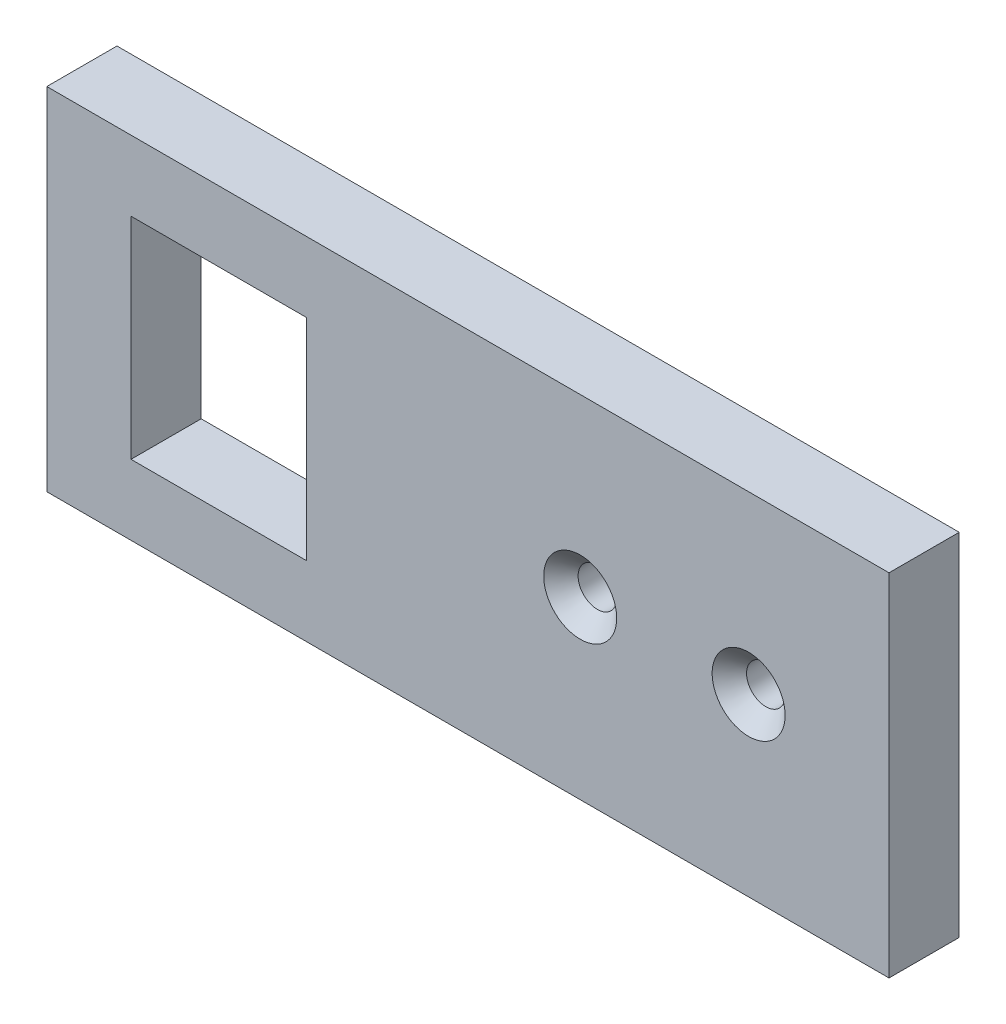
ISO-10303-21;
HEADER;
FILE_DESCRIPTION(('STEP AP214'),'2;1');
FILE_NAME('part.step','',(''),(''),'','','');
FILE_SCHEMA(('AUTOMOTIVE_DESIGN { 1 0 10303 214 1 1 1 1 }'));
ENDSEC;
DATA;
#1=APPLICATION_CONTEXT('core data for automotive mechanical design processes');
#2=APPLICATION_PROTOCOL_DEFINITION('international standard','automotive_design',2000,#1);
#3=PRODUCT_CONTEXT('',#1,'mechanical');
#4=PRODUCT('Part','Part','',(#3));
#5=PRODUCT_RELATED_PRODUCT_CATEGORY('part','',(#4));
#6=PRODUCT_DEFINITION_FORMATION('','',#4);
#7=PRODUCT_DEFINITION_CONTEXT('part definition',#1,'design');
#8=PRODUCT_DEFINITION('design','',#6,#7);
#9=PRODUCT_DEFINITION_SHAPE('','',#8);
#10=(LENGTH_UNIT() NAMED_UNIT(*) SI_UNIT(.MILLI.,.METRE.));
#11=(NAMED_UNIT(*) PLANE_ANGLE_UNIT() SI_UNIT($,.RADIAN.));
#12=(NAMED_UNIT(*) SI_UNIT($,.STERADIAN.) SOLID_ANGLE_UNIT());
#13=UNCERTAINTY_MEASURE_WITH_UNIT(LENGTH_MEASURE(1.E-05),#10,'distance_accuracy_value','');
#14=(GEOMETRIC_REPRESENTATION_CONTEXT(3) GLOBAL_UNCERTAINTY_ASSIGNED_CONTEXT((#13)) GLOBAL_UNIT_ASSIGNED_CONTEXT((#10,
#11,#12)) REPRESENTATION_CONTEXT('',''));
#15=CARTESIAN_POINT('',(0.,0.,0.));
#16=DIRECTION('',(0.,0.,1.));
#17=DIRECTION('',(1.,0.,0.));
#18=AXIS2_PLACEMENT_3D('',#15,#16,#17);
#19=CARTESIAN_POINT('',(-60.,25.,10.));
#20=DIRECTION('',(1.,0.,0.));
#21=DIRECTION('',(0.,1.,0.));
#22=AXIS2_PLACEMENT_3D('',#19,#20,#21);
#23=PLANE('',#22);
#24=DIRECTION('',(0.,-1.,0.));
#25=VECTOR('',#24,1.);
#26=CARTESIAN_POINT('',(-60.,25.,0.));
#27=LINE('',#26,#25);
#28=CARTESIAN_POINT('',(-60.,25.,0.));
#29=VERTEX_POINT('',#28);
#30=CARTESIAN_POINT('',(-60.,-25.,0.));
#31=VERTEX_POINT('',#30);
#32=EDGE_CURVE('E133',#29,#31,#27,.T.);
#33=ORIENTED_EDGE('',*,*,#32,.T.);
#34=DIRECTION('',(0.,0.,-1.));
#35=VECTOR('',#34,1.);
#36=CARTESIAN_POINT('',(-60.,-25.,10.));
#37=LINE('',#36,#35);
#38=CARTESIAN_POINT('',(-60.,-25.,10.));
#39=VERTEX_POINT('',#38);
#40=EDGE_CURVE('E11',#39,#31,#37,.T.);
#41=ORIENTED_EDGE('',*,*,#40,.F.);
#42=DIRECTION('',(0.,-1.,0.));
#43=VECTOR('',#42,1.);
#44=CARTESIAN_POINT('',(-60.,25.,10.));
#45=LINE('',#44,#43);
#46=CARTESIAN_POINT('',(-60.,25.,10.));
#47=VERTEX_POINT('',#46);
#48=EDGE_CURVE('E137',#47,#39,#45,.T.);
#49=ORIENTED_EDGE('',*,*,#48,.F.);
#50=DIRECTION('',(0.,0.,-1.));
#51=VECTOR('',#50,1.);
#52=CARTESIAN_POINT('',(-60.,25.,10.));
#53=LINE('',#52,#51);
#54=EDGE_CURVE('E147',#47,#29,#53,.T.);
#55=ORIENTED_EDGE('',*,*,#54,.T.);
#56=EDGE_LOOP('',(#33,#41,#49,#55));
#57=FACE_BOUND('',#56,.T.);
#58=ADVANCED_FACE('F33',(#57),#23,.F.);
#59=CARTESIAN_POINT('',(60.,-25.,10.));
#60=DIRECTION('',(0.,1.,0.));
#61=DIRECTION('',(-1.,0.,0.));
#62=AXIS2_PLACEMENT_3D('',#59,#60,#61);
#63=PLANE('',#62);
#64=DIRECTION('',(1.,0.,0.));
#65=VECTOR('',#64,1.);
#66=CARTESIAN_POINT('',(60.,-25.,0.));
#67=LINE('',#66,#65);
#68=CARTESIAN_POINT('',(60.,-25.,0.));
#69=VERTEX_POINT('',#68);
#70=EDGE_CURVE('E150',#31,#69,#67,.T.);
#71=ORIENTED_EDGE('',*,*,#70,.T.);
#72=DIRECTION('',(0.,0.,-1.));
#73=VECTOR('',#72,1.);
#74=CARTESIAN_POINT('',(60.,-25.,10.));
#75=LINE('',#74,#73);
#76=CARTESIAN_POINT('',(60.,-25.,10.));
#77=VERTEX_POINT('',#76);
#78=EDGE_CURVE('E40',#77,#69,#75,.T.);
#79=ORIENTED_EDGE('',*,*,#78,.F.);
#80=DIRECTION('',(1.,0.,0.));
#81=VECTOR('',#80,1.);
#82=CARTESIAN_POINT('',(60.,-25.,10.));
#83=LINE('',#82,#81);
#84=EDGE_CURVE('E140',#39,#77,#83,.T.);
#85=ORIENTED_EDGE('',*,*,#84,.F.);
#86=ORIENTED_EDGE('',*,*,#40,.T.);
#87=EDGE_LOOP('',(#71,#79,#85,#86));
#88=FACE_BOUND('',#87,.T.);
#89=ADVANCED_FACE('F178',(#88),#63,.F.);
#90=CARTESIAN_POINT('',(60.,25.,10.));
#91=DIRECTION('',(-1.,0.,0.));
#92=DIRECTION('',(0.,-1.,0.));
#93=AXIS2_PLACEMENT_3D('',#90,#91,#92);
#94=PLANE('',#93);
#95=DIRECTION('',(0.,1.,0.));
#96=VECTOR('',#95,1.);
#97=CARTESIAN_POINT('',(60.,25.,0.));
#98=LINE('',#97,#96);
#99=CARTESIAN_POINT('',(60.,25.,0.));
#100=VERTEX_POINT('',#99);
#101=EDGE_CURVE('E152',#69,#100,#98,.T.);
#102=ORIENTED_EDGE('',*,*,#101,.T.);
#103=DIRECTION('',(0.,0.,-1.));
#104=VECTOR('',#103,1.);
#105=CARTESIAN_POINT('',(60.,25.,10.));
#106=LINE('',#105,#104);
#107=CARTESIAN_POINT('',(60.,25.,10.));
#108=VERTEX_POINT('',#107);
#109=EDGE_CURVE('E157',#108,#100,#106,.T.);
#110=ORIENTED_EDGE('',*,*,#109,.F.);
#111=DIRECTION('',(0.,1.,0.));
#112=VECTOR('',#111,1.);
#113=CARTESIAN_POINT('',(60.,25.,10.));
#114=LINE('',#113,#112);
#115=EDGE_CURVE('E143',#77,#108,#114,.T.);
#116=ORIENTED_EDGE('',*,*,#115,.F.);
#117=ORIENTED_EDGE('',*,*,#78,.T.);
#118=EDGE_LOOP('',(#102,#110,#116,#117));
#119=FACE_BOUND('',#118,.T.);
#120=ADVANCED_FACE('F164',(#119),#94,.F.);
#121=CARTESIAN_POINT('',(60.,25.,10.));
#122=DIRECTION('',(0.,-1.,0.));
#123=DIRECTION('',(1.,0.,0.));
#124=AXIS2_PLACEMENT_3D('',#121,#122,#123);
#125=PLANE('',#124);
#126=DIRECTION('',(-1.,0.,0.));
#127=VECTOR('',#126,1.);
#128=CARTESIAN_POINT('',(60.,25.,0.));
#129=LINE('',#128,#127);
#130=EDGE_CURVE('E141',#100,#29,#129,.T.);
#131=ORIENTED_EDGE('',*,*,#130,.T.);
#132=ORIENTED_EDGE('',*,*,#54,.F.);
#133=DIRECTION('',(-1.,0.,0.));
#134=VECTOR('',#133,1.);
#135=CARTESIAN_POINT('',(60.,25.,10.));
#136=LINE('',#135,#134);
#137=EDGE_CURVE('E145',#108,#47,#136,.T.);
#138=ORIENTED_EDGE('',*,*,#137,.F.);
#139=ORIENTED_EDGE('',*,*,#109,.T.);
#140=EDGE_LOOP('',(#131,#132,#138,#139));
#141=FACE_BOUND('',#140,.T.);
#142=ADVANCED_FACE('F171',(#141),#125,.F.);
#143=CARTESIAN_POINT('',(0.,0.,10.));
#144=DIRECTION('',(0.,0.,-1.));
#145=DIRECTION('',(-1.,0.,0.));
#146=AXIS2_PLACEMENT_3D('',#143,#144,#145);
#147=PLANE('',#146);
#148=CARTESIAN_POINT('',(16.,0.,10.));
#149=DIRECTION('',(0.,0.,1.));
#150=DIRECTION('',(1.,0.,0.));
#151=AXIS2_PLACEMENT_3D('',#148,#149,#150);
#152=CIRCLE('',#151,5.2);
#153=CARTESIAN_POINT('',(21.2,0.,10.));
#154=VERTEX_POINT('',#153);
#155=EDGE_CURVE('E228',#154,#154,#152,.T.);
#156=ORIENTED_EDGE('',*,*,#155,.F.);
#157=EDGE_LOOP('',(#156));
#158=FACE_BOUND('',#157,.T.);
#159=CARTESIAN_POINT('',(40.,0.,10.));
#160=DIRECTION('',(0.,0.,1.));
#161=DIRECTION('',(1.,0.,0.));
#162=AXIS2_PLACEMENT_3D('',#159,#160,#161);
#163=CIRCLE('',#162,5.2);
#164=CARTESIAN_POINT('',(45.2,0.,10.));
#165=VERTEX_POINT('',#164);
#166=EDGE_CURVE('E235',#165,#165,#163,.T.);
#167=ORIENTED_EDGE('',*,*,#166,.F.);
#168=EDGE_LOOP('',(#167));
#169=FACE_BOUND('',#168,.T.);
#170=DIRECTION('',(1.,0.,0.));
#171=VECTOR('',#170,1.);
#172=CARTESIAN_POINT('',(-23.,-15.,10.));
#173=LINE('',#172,#171);
#174=CARTESIAN_POINT('',(-48.,-15.,10.));
#175=VERTEX_POINT('',#174);
#176=CARTESIAN_POINT('',(-23.,-15.,10.));
#177=VERTEX_POINT('',#176);
#178=EDGE_CURVE('E127',#175,#177,#173,.T.);
#179=ORIENTED_EDGE('',*,*,#178,.F.);
#180=DIRECTION('',(0.,-1.,0.));
#181=VECTOR('',#180,1.);
#182=CARTESIAN_POINT('',(-48.,15.,10.));
#183=LINE('',#182,#181);
#184=CARTESIAN_POINT('',(-48.,15.,10.));
#185=VERTEX_POINT('',#184);
#186=EDGE_CURVE('E47',#185,#175,#183,.T.);
#187=ORIENTED_EDGE('',*,*,#186,.F.);
#188=DIRECTION('',(-1.,0.,0.));
#189=VECTOR('',#188,1.);
#190=CARTESIAN_POINT('',(-23.,15.,10.));
#191=LINE('',#190,#189);
#192=CARTESIAN_POINT('',(-23.,15.,10.));
#193=VERTEX_POINT('',#192);
#194=EDGE_CURVE('E115',#193,#185,#191,.T.);
#195=ORIENTED_EDGE('',*,*,#194,.F.);
#196=DIRECTION('',(0.,1.,0.));
#197=VECTOR('',#196,1.);
#198=CARTESIAN_POINT('',(-23.,15.,10.));
#199=LINE('',#198,#197);
#200=EDGE_CURVE('E118',#177,#193,#199,.T.);
#201=ORIENTED_EDGE('',*,*,#200,.F.);
#202=EDGE_LOOP('',(#179,#187,#195,#201));
#203=FACE_BOUND('',#202,.T.);
#204=ORIENTED_EDGE('',*,*,#48,.T.);
#205=ORIENTED_EDGE('',*,*,#84,.T.);
#206=ORIENTED_EDGE('',*,*,#115,.T.);
#207=ORIENTED_EDGE('',*,*,#137,.T.);
#208=EDGE_LOOP('',(#204,#205,#206,#207));
#209=FACE_BOUND('',#208,.T.);
#210=ADVANCED_FACE('F177',(#158,#169,#203,#209),#147,.F.);
#211=CARTESIAN_POINT('',(0.,0.,0.));
#212=DIRECTION('',(0.,0.,-1.));
#213=DIRECTION('',(-1.,0.,0.));
#214=AXIS2_PLACEMENT_3D('',#211,#212,#213);
#215=PLANE('',#214);
#216=CARTESIAN_POINT('',(16.,0.,0.));
#217=DIRECTION('',(0.,0.,1.));
#218=DIRECTION('',(1.,0.,0.));
#219=AXIS2_PLACEMENT_3D('',#216,#217,#218);
#220=CIRCLE('',#219,2.75);
#221=CARTESIAN_POINT('',(18.75,0.,0.));
#222=VERTEX_POINT('',#221);
#223=EDGE_CURVE('E230',#222,#222,#220,.T.);
#224=ORIENTED_EDGE('',*,*,#223,.T.);
#225=EDGE_LOOP('',(#224));
#226=FACE_BOUND('',#225,.T.);
#227=CARTESIAN_POINT('',(40.,0.,0.));
#228=DIRECTION('',(0.,0.,1.));
#229=DIRECTION('',(1.,0.,0.));
#230=AXIS2_PLACEMENT_3D('',#227,#228,#229);
#231=CIRCLE('',#230,2.75);
#232=CARTESIAN_POINT('',(42.75,0.,0.));
#233=VERTEX_POINT('',#232);
#234=EDGE_CURVE('E121',#233,#233,#231,.T.);
#235=ORIENTED_EDGE('',*,*,#234,.T.);
#236=EDGE_LOOP('',(#235));
#237=FACE_BOUND('',#236,.T.);
#238=DIRECTION('',(0.,-1.,0.));
#239=VECTOR('',#238,1.);
#240=CARTESIAN_POINT('',(-48.,15.,0.));
#241=LINE('',#240,#239);
#242=CARTESIAN_POINT('',(-48.,15.,0.));
#243=VERTEX_POINT('',#242);
#244=CARTESIAN_POINT('',(-48.,-15.,0.));
#245=VERTEX_POINT('',#244);
#246=EDGE_CURVE('E99',#243,#245,#241,.T.);
#247=ORIENTED_EDGE('',*,*,#246,.T.);
#248=DIRECTION('',(1.,0.,0.));
#249=VECTOR('',#248,1.);
#250=CARTESIAN_POINT('',(-23.,-15.,0.));
#251=LINE('',#250,#249);
#252=CARTESIAN_POINT('',(-23.,-15.,0.));
#253=VERTEX_POINT('',#252);
#254=EDGE_CURVE('E108',#245,#253,#251,.T.);
#255=ORIENTED_EDGE('',*,*,#254,.T.);
#256=DIRECTION('',(0.,1.,0.));
#257=VECTOR('',#256,1.);
#258=CARTESIAN_POINT('',(-23.,15.,0.));
#259=LINE('',#258,#257);
#260=CARTESIAN_POINT('',(-23.,15.,0.));
#261=VERTEX_POINT('',#260);
#262=EDGE_CURVE('E55',#253,#261,#259,.T.);
#263=ORIENTED_EDGE('',*,*,#262,.T.);
#264=DIRECTION('',(-1.,0.,0.));
#265=VECTOR('',#264,1.);
#266=CARTESIAN_POINT('',(-23.,15.,0.));
#267=LINE('',#266,#265);
#268=EDGE_CURVE('E105',#261,#243,#267,.T.);
#269=ORIENTED_EDGE('',*,*,#268,.T.);
#270=EDGE_LOOP('',(#247,#255,#263,#269));
#271=FACE_BOUND('',#270,.T.);
#272=ORIENTED_EDGE('',*,*,#32,.F.);
#273=ORIENTED_EDGE('',*,*,#130,.F.);
#274=ORIENTED_EDGE('',*,*,#101,.F.);
#275=ORIENTED_EDGE('',*,*,#70,.F.);
#276=EDGE_LOOP('',(#272,#273,#274,#275));
#277=FACE_BOUND('',#276,.T.);
#278=ADVANCED_FACE('F112',(#226,#237,#271,#277),#215,.T.);
#279=CARTESIAN_POINT('',(-48.,15.,0.));
#280=DIRECTION('',(-1.,0.,0.));
#281=DIRECTION('',(0.,0.,1.));
#282=AXIS2_PLACEMENT_3D('',#279,#280,#281);
#283=PLANE('',#282);
#284=ORIENTED_EDGE('',*,*,#186,.T.);
#285=DIRECTION('',(0.,0.,1.));
#286=VECTOR('',#285,1.);
#287=CARTESIAN_POINT('',(-48.,-15.,0.));
#288=LINE('',#287,#286);
#289=EDGE_CURVE('E95',#245,#175,#288,.T.);
#290=ORIENTED_EDGE('',*,*,#289,.F.);
#291=ORIENTED_EDGE('',*,*,#246,.F.);
#292=DIRECTION('',(0.,0.,1.));
#293=VECTOR('',#292,1.);
#294=CARTESIAN_POINT('',(-48.,15.,0.));
#295=LINE('',#294,#293);
#296=EDGE_CURVE('E131',#243,#185,#295,.T.);
#297=ORIENTED_EDGE('',*,*,#296,.T.);
#298=EDGE_LOOP('',(#284,#290,#291,#297));
#299=FACE_BOUND('',#298,.T.);
#300=ADVANCED_FACE('F97',(#299),#283,.F.);
#301=CARTESIAN_POINT('',(-23.,15.,0.));
#302=DIRECTION('',(0.,1.,0.));
#303=DIRECTION('',(-1.,0.,0.));
#304=AXIS2_PLACEMENT_3D('',#301,#302,#303);
#305=PLANE('',#304);
#306=ORIENTED_EDGE('',*,*,#194,.T.);
#307=ORIENTED_EDGE('',*,*,#296,.F.);
#308=ORIENTED_EDGE('',*,*,#268,.F.);
#309=DIRECTION('',(0.,0.,1.));
#310=VECTOR('',#309,1.);
#311=CARTESIAN_POINT('',(-23.,15.,0.));
#312=LINE('',#311,#310);
#313=EDGE_CURVE('E134',#261,#193,#312,.T.);
#314=ORIENTED_EDGE('',*,*,#313,.T.);
#315=EDGE_LOOP('',(#306,#307,#308,#314));
#316=FACE_BOUND('',#315,.T.);
#317=ADVANCED_FACE('F196',(#316),#305,.F.);
#318=CARTESIAN_POINT('',(-23.,15.,0.));
#319=DIRECTION('',(1.,0.,0.));
#320=DIRECTION('',(0.,0.,-1.));
#321=AXIS2_PLACEMENT_3D('',#318,#319,#320);
#322=PLANE('',#321);
#323=ORIENTED_EDGE('',*,*,#200,.T.);
#324=ORIENTED_EDGE('',*,*,#313,.F.);
#325=ORIENTED_EDGE('',*,*,#262,.F.);
#326=DIRECTION('',(0.,0.,1.));
#327=VECTOR('',#326,1.);
#328=CARTESIAN_POINT('',(-23.,-15.,0.));
#329=LINE('',#328,#327);
#330=EDGE_CURVE('E104',#253,#177,#329,.T.);
#331=ORIENTED_EDGE('',*,*,#330,.T.);
#332=EDGE_LOOP('',(#323,#324,#325,#331));
#333=FACE_BOUND('',#332,.T.);
#334=ADVANCED_FACE('F200',(#333),#322,.F.);
#335=CARTESIAN_POINT('',(-23.,-15.,0.));
#336=DIRECTION('',(0.,-1.,0.));
#337=DIRECTION('',(1.,0.,0.));
#338=AXIS2_PLACEMENT_3D('',#335,#336,#337);
#339=PLANE('',#338);
#340=ORIENTED_EDGE('',*,*,#178,.T.);
#341=ORIENTED_EDGE('',*,*,#330,.F.);
#342=ORIENTED_EDGE('',*,*,#254,.F.);
#343=ORIENTED_EDGE('',*,*,#289,.T.);
#344=EDGE_LOOP('',(#340,#341,#342,#343));
#345=FACE_BOUND('',#344,.T.);
#346=ADVANCED_FACE('F109',(#345),#339,.F.);
#347=CARTESIAN_POINT('',(40.,0.,10.));
#348=DIRECTION('',(0.,0.,1.));
#349=DIRECTION('',(1.,0.,0.));
#350=AXIS2_PLACEMENT_3D('',#347,#348,#349);
#351=CYLINDRICAL_SURFACE('',#350,2.75);
#352=ORIENTED_EDGE('',*,*,#234,.F.);
#353=EDGE_LOOP('',(#352));
#354=FACE_BOUND('',#353,.T.);
#355=CARTESIAN_POINT('',(40.,0.,7.55));
#356=DIRECTION('',(0.,0.,1.));
#357=DIRECTION('',(1.,0.,0.));
#358=AXIS2_PLACEMENT_3D('',#355,#356,#357);
#359=CIRCLE('',#358,2.75);
#360=CARTESIAN_POINT('',(42.75,0.,7.55));
#361=VERTEX_POINT('',#360);
#362=EDGE_CURVE('E237',#361,#361,#359,.T.);
#363=ORIENTED_EDGE('',*,*,#362,.T.);
#364=EDGE_LOOP('',(#363));
#365=FACE_BOUND('',#364,.T.);
#366=ADVANCED_FACE('F199',(#354,#365),#351,.F.);
#367=CARTESIAN_POINT('',(40.,0.,10.));
#368=DIRECTION('',(0.,0.,1.));
#369=DIRECTION('',(1.,0.,0.));
#370=AXIS2_PLACEMENT_3D('',#367,#368,#369);
#371=CONICAL_SURFACE('',#370,5.2,0.785398163397448);
#372=ORIENTED_EDGE('',*,*,#362,.F.);
#373=EDGE_LOOP('',(#372));
#374=FACE_BOUND('',#373,.T.);
#375=ORIENTED_EDGE('',*,*,#166,.T.);
#376=EDGE_LOOP('',(#375));
#377=FACE_BOUND('',#376,.T.);
#378=ADVANCED_FACE('F208',(#374,#377),#371,.F.);
#379=CARTESIAN_POINT('',(16.,0.,10.));
#380=DIRECTION('',(0.,0.,1.));
#381=DIRECTION('',(1.,0.,0.));
#382=AXIS2_PLACEMENT_3D('',#379,#380,#381);
#383=CYLINDRICAL_SURFACE('',#382,2.75);
#384=ORIENTED_EDGE('',*,*,#223,.F.);
#385=EDGE_LOOP('',(#384));
#386=FACE_BOUND('',#385,.T.);
#387=CARTESIAN_POINT('',(16.,0.,7.55));
#388=DIRECTION('',(0.,0.,1.));
#389=DIRECTION('',(1.,0.,0.));
#390=AXIS2_PLACEMENT_3D('',#387,#388,#389);
#391=CIRCLE('',#390,2.75);
#392=CARTESIAN_POINT('',(18.75,0.,7.55));
#393=VERTEX_POINT('',#392);
#394=EDGE_CURVE('E225',#393,#393,#391,.T.);
#395=ORIENTED_EDGE('',*,*,#394,.T.);
#396=EDGE_LOOP('',(#395));
#397=FACE_BOUND('',#396,.T.);
#398=ADVANCED_FACE('F212',(#386,#397),#383,.F.);
#399=CARTESIAN_POINT('',(16.,0.,10.));
#400=DIRECTION('',(0.,0.,1.));
#401=DIRECTION('',(1.,0.,0.));
#402=AXIS2_PLACEMENT_3D('',#399,#400,#401);
#403=CONICAL_SURFACE('',#402,5.2,0.785398163397448);
#404=ORIENTED_EDGE('',*,*,#394,.F.);
#405=EDGE_LOOP('',(#404));
#406=FACE_BOUND('',#405,.T.);
#407=ORIENTED_EDGE('',*,*,#155,.T.);
#408=EDGE_LOOP('',(#407));
#409=FACE_BOUND('',#408,.T.);
#410=ADVANCED_FACE('F216',(#406,#409),#403,.F.);
#411=CLOSED_SHELL('',(#58,#89,#120,#142,#210,#278,#300,#317,#334,#346,#366,#378,#398,#410));
#412=MANIFOLD_SOLID_BREP('B2',#411);
#413=ADVANCED_BREP_SHAPE_REPRESENTATION('',(#18,#412),#14);
#414=SHAPE_DEFINITION_REPRESENTATION(#9,#413);
ENDSEC;
END-ISO-10303-21;
